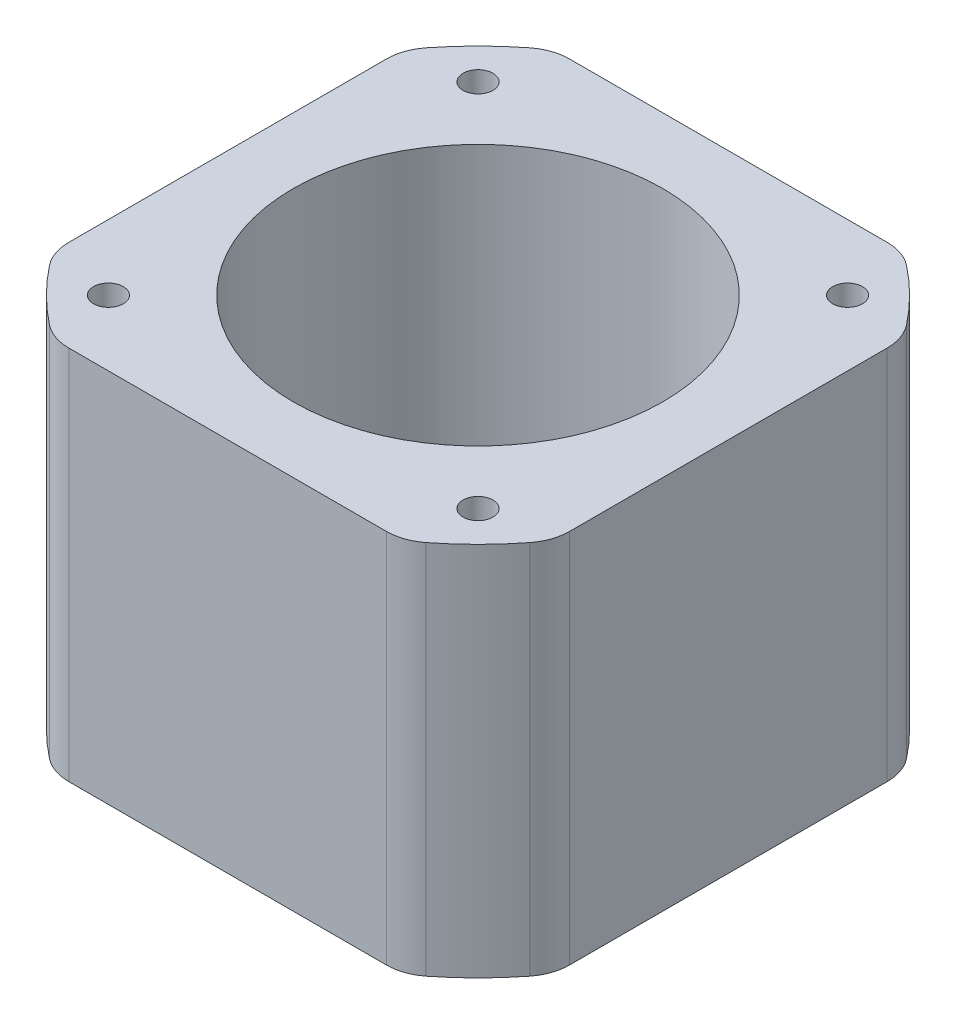
ISO-10303-21;
HEADER;
FILE_DESCRIPTION(('STEP AP214'),'2;1');
FILE_NAME('part.step','',(''),(''),'','','');
FILE_SCHEMA(('AUTOMOTIVE_DESIGN { 1 0 10303 214 1 1 1 1 }'));
ENDSEC;
DATA;
#1=APPLICATION_CONTEXT('core data for automotive mechanical design processes');
#2=APPLICATION_PROTOCOL_DEFINITION('international standard','automotive_design',2000,#1);
#3=PRODUCT_CONTEXT('',#1,'mechanical');
#4=PRODUCT('Part','Part','',(#3));
#5=PRODUCT_RELATED_PRODUCT_CATEGORY('part','',(#4));
#6=PRODUCT_DEFINITION_FORMATION('','',#4);
#7=PRODUCT_DEFINITION_CONTEXT('part definition',#1,'design');
#8=PRODUCT_DEFINITION('design','',#6,#7);
#9=PRODUCT_DEFINITION_SHAPE('','',#8);
#10=(LENGTH_UNIT() NAMED_UNIT(*) SI_UNIT(.MILLI.,.METRE.));
#11=(NAMED_UNIT(*) PLANE_ANGLE_UNIT() SI_UNIT($,.RADIAN.));
#12=(NAMED_UNIT(*) SI_UNIT($,.STERADIAN.) SOLID_ANGLE_UNIT());
#13=UNCERTAINTY_MEASURE_WITH_UNIT(LENGTH_MEASURE(1.E-05),#10,'distance_accuracy_value','');
#14=(GEOMETRIC_REPRESENTATION_CONTEXT(3) GLOBAL_UNCERTAINTY_ASSIGNED_CONTEXT((#13)) GLOBAL_UNIT_ASSIGNED_CONTEXT((#10,
#11,#12)) REPRESENTATION_CONTEXT('',''));
#15=CARTESIAN_POINT('',(0.,0.,0.));
#16=DIRECTION('',(0.,0.,1.));
#17=DIRECTION('',(1.,0.,0.));
#18=AXIS2_PLACEMENT_3D('',#15,#16,#17);
#19=CARTESIAN_POINT('',(15.5,31.5,15.5));
#20=DIRECTION('',(0.,-1.,0.));
#21=DIRECTION('',(0.,0.,-1.));
#22=AXIS2_PLACEMENT_3D('',#19,#20,#21);
#23=CYLINDRICAL_SURFACE('',#22,1.25000000000001);
#24=CARTESIAN_POINT('',(15.5,31.5,15.5));
#25=DIRECTION('',(0.,-1.,0.));
#26=DIRECTION('',(0.,0.,-1.));
#27=AXIS2_PLACEMENT_3D('',#24,#25,#26);
#28=CIRCLE('',#27,1.25000000000001);
#29=CARTESIAN_POINT('',(15.5,31.5,14.25));
#30=VERTEX_POINT('',#29);
#31=EDGE_CURVE('E206',#30,#30,#28,.T.);
#32=ORIENTED_EDGE('',*,*,#31,.F.);
#33=EDGE_LOOP('',(#32));
#34=FACE_BOUND('',#33,.T.);
#35=CARTESIAN_POINT('',(15.5,0.,15.5));
#36=DIRECTION('',(0.,-1.,0.));
#37=DIRECTION('',(0.,0.,-1.));
#38=AXIS2_PLACEMENT_3D('',#35,#36,#37);
#39=CIRCLE('',#38,1.25000000000001);
#40=CARTESIAN_POINT('',(15.5,0.,14.25));
#41=VERTEX_POINT('',#40);
#42=EDGE_CURVE('E28',#41,#41,#39,.T.);
#43=ORIENTED_EDGE('',*,*,#42,.T.);
#44=EDGE_LOOP('',(#43));
#45=FACE_BOUND('',#44,.T.);
#46=ADVANCED_FACE('F25',(#34,#45),#23,.F.);
#47=CARTESIAN_POINT('',(-15.5,31.5,-15.5));
#48=DIRECTION('',(0.,-1.,0.));
#49=DIRECTION('',(0.,0.,-1.));
#50=AXIS2_PLACEMENT_3D('',#47,#48,#49);
#51=CYLINDRICAL_SURFACE('',#50,1.25000000000001);
#52=CARTESIAN_POINT('',(-15.5,31.5,-15.5));
#53=DIRECTION('',(0.,-1.,0.));
#54=DIRECTION('',(0.,0.,-1.));
#55=AXIS2_PLACEMENT_3D('',#52,#53,#54);
#56=CIRCLE('',#55,1.25000000000001);
#57=CARTESIAN_POINT('',(-15.5,31.5,-16.75));
#58=VERTEX_POINT('',#57);
#59=EDGE_CURVE('E209',#58,#58,#56,.T.);
#60=ORIENTED_EDGE('',*,*,#59,.F.);
#61=EDGE_LOOP('',(#60));
#62=FACE_BOUND('',#61,.T.);
#63=CARTESIAN_POINT('',(-15.5,0.,-15.5));
#64=DIRECTION('',(0.,-1.,0.));
#65=DIRECTION('',(0.,0.,-1.));
#66=AXIS2_PLACEMENT_3D('',#63,#64,#65);
#67=CIRCLE('',#66,1.25000000000001);
#68=CARTESIAN_POINT('',(-15.5,0.,-16.75));
#69=VERTEX_POINT('',#68);
#70=EDGE_CURVE('E164',#69,#69,#67,.T.);
#71=ORIENTED_EDGE('',*,*,#70,.T.);
#72=EDGE_LOOP('',(#71));
#73=FACE_BOUND('',#72,.T.);
#74=ADVANCED_FACE('F528',(#62,#73),#51,.F.);
#75=CARTESIAN_POINT('',(0.,31.5,0.));
#76=DIRECTION('',(0.,-1.,0.));
#77=DIRECTION('',(0.,0.,-1.));
#78=AXIS2_PLACEMENT_3D('',#75,#76,#77);
#79=CYLINDRICAL_SURFACE('',#78,25.6);
#80=CARTESIAN_POINT('',(0.,31.5,0.));
#81=DIRECTION('',(0.,-1.,0.));
#82=DIRECTION('',(0.,0.,-1.));
#83=AXIS2_PLACEMENT_3D('',#80,#81,#82);
#84=CIRCLE('',#83,25.6);
#85=CARTESIAN_POINT('',(-15.7927871574424,31.5,-20.1481481481482));
#86=VERTEX_POINT('',#85);
#87=CARTESIAN_POINT('',(-20.1481481481482,31.5,-15.7927871574423));
#88=VERTEX_POINT('',#87);
#89=EDGE_CURVE('E212',#86,#88,#84,.F.);
#90=ORIENTED_EDGE('',*,*,#89,.F.);
#91=DIRECTION('',(0.,-1.,0.));
#92=VECTOR('',#91,1.);
#93=CARTESIAN_POINT('',(-15.7927871574424,31.5,-20.1481481481482));
#94=LINE('',#93,#92);
#95=CARTESIAN_POINT('',(-15.7927871574424,0.,-20.1481481481482));
#96=VERTEX_POINT('',#95);
#97=EDGE_CURVE('E276',#96,#86,#94,.F.);
#98=ORIENTED_EDGE('',*,*,#97,.F.);
#99=CARTESIAN_POINT('',(0.,0.,0.));
#100=DIRECTION('',(0.,-1.,0.));
#101=DIRECTION('',(0.,0.,-1.));
#102=AXIS2_PLACEMENT_3D('',#99,#100,#101);
#103=CIRCLE('',#102,25.6);
#104=CARTESIAN_POINT('',(-20.1481481481482,0.,-15.7927871574423));
#105=VERTEX_POINT('',#104);
#106=EDGE_CURVE('E193',#96,#105,#103,.F.);
#107=ORIENTED_EDGE('',*,*,#106,.T.);
#108=DIRECTION('',(0.,-1.,0.));
#109=VECTOR('',#108,1.);
#110=CARTESIAN_POINT('',(-20.1481481481482,31.5,-15.7927871574423));
#111=LINE('',#110,#109);
#112=EDGE_CURVE('E246',#88,#105,#111,.T.);
#113=ORIENTED_EDGE('',*,*,#112,.F.);
#114=EDGE_LOOP('',(#90,#98,#107,#113));
#115=FACE_BOUND('',#114,.T.);
#116=ADVANCED_FACE('F320',(#115),#79,.T.);
#117=CARTESIAN_POINT('',(-17.,31.5,-13.325164164092));
#118=DIRECTION('',(0.,-1.,0.));
#119=DIRECTION('',(0.,0.,-1.));
#120=AXIS2_PLACEMENT_3D('',#117,#118,#119);
#121=CYLINDRICAL_SURFACE('',#120,4.);
#122=CARTESIAN_POINT('',(-17.,0.,-13.325164164092));
#123=DIRECTION('',(0.,-1.,0.));
#124=DIRECTION('',(0.,0.,-1.));
#125=AXIS2_PLACEMENT_3D('',#122,#123,#124);
#126=CIRCLE('',#125,4.);
#127=CARTESIAN_POINT('',(-21.,0.,-13.325164164092));
#128=VERTEX_POINT('',#127);
#129=EDGE_CURVE('E196',#105,#128,#126,.F.);
#130=ORIENTED_EDGE('',*,*,#129,.T.);
#131=DIRECTION('',(0.,1.,0.));
#132=VECTOR('',#131,1.);
#133=CARTESIAN_POINT('',(-21.,31.5,-13.325164164092));
#134=LINE('',#133,#132);
#135=CARTESIAN_POINT('',(-21.,31.5,-13.325164164092));
#136=VERTEX_POINT('',#135);
#137=EDGE_CURVE('E248',#128,#136,#134,.T.);
#138=ORIENTED_EDGE('',*,*,#137,.T.);
#139=CARTESIAN_POINT('',(-17.,31.5,-13.325164164092));
#140=DIRECTION('',(0.,-1.,0.));
#141=DIRECTION('',(0.,0.,-1.));
#142=AXIS2_PLACEMENT_3D('',#139,#140,#141);
#143=CIRCLE('',#142,4.);
#144=EDGE_CURVE('E214',#88,#136,#143,.F.);
#145=ORIENTED_EDGE('',*,*,#144,.F.);
#146=ORIENTED_EDGE('',*,*,#112,.T.);
#147=EDGE_LOOP('',(#130,#138,#145,#146));
#148=FACE_BOUND('',#147,.T.);
#149=ADVANCED_FACE('F324',(#148),#121,.T.);
#150=CARTESIAN_POINT('',(-21.,31.5,14.641038214553));
#151=DIRECTION('',(1.,0.,0.));
#152=DIRECTION('',(0.,0.,-1.));
#153=AXIS2_PLACEMENT_3D('',#150,#151,#152);
#154=PLANE('',#153);
#155=ORIENTED_EDGE('',*,*,#137,.F.);
#156=DIRECTION('',(0.,0.,1.));
#157=VECTOR('',#156,1.);
#158=CARTESIAN_POINT('',(-21.,0.,0.));
#159=LINE('',#158,#157);
#160=CARTESIAN_POINT('',(-21.,0.,13.325164164092));
#161=VERTEX_POINT('',#160);
#162=EDGE_CURVE('E199',#128,#161,#159,.T.);
#163=ORIENTED_EDGE('',*,*,#162,.T.);
#164=DIRECTION('',(0.,-1.,0.));
#165=VECTOR('',#164,1.);
#166=CARTESIAN_POINT('',(-21.,31.5,13.325164164092));
#167=LINE('',#166,#165);
#168=CARTESIAN_POINT('',(-21.,31.5,13.325164164092));
#169=VERTEX_POINT('',#168);
#170=EDGE_CURVE('E136',#169,#161,#167,.T.);
#171=ORIENTED_EDGE('',*,*,#170,.F.);
#172=DIRECTION('',(0.,0.,1.));
#173=VECTOR('',#172,1.);
#174=CARTESIAN_POINT('',(-21.,31.5,0.));
#175=LINE('',#174,#173);
#176=EDGE_CURVE('E216',#136,#169,#175,.T.);
#177=ORIENTED_EDGE('',*,*,#176,.F.);
#178=EDGE_LOOP('',(#155,#163,#171,#177));
#179=FACE_BOUND('',#178,.T.);
#180=ADVANCED_FACE('F327',(#179),#154,.F.);
#181=CARTESIAN_POINT('',(-17.,31.5,13.325164164092));
#182=DIRECTION('',(0.,-1.,0.));
#183=DIRECTION('',(0.,0.,-1.));
#184=AXIS2_PLACEMENT_3D('',#181,#182,#183);
#185=CYLINDRICAL_SURFACE('',#184,4.);
#186=CARTESIAN_POINT('',(-17.,0.,13.325164164092));
#187=DIRECTION('',(0.,-1.,0.));
#188=DIRECTION('',(0.,0.,-1.));
#189=AXIS2_PLACEMENT_3D('',#186,#187,#188);
#190=CIRCLE('',#189,4.);
#191=CARTESIAN_POINT('',(-20.1481481481482,0.,15.7927871574423));
#192=VERTEX_POINT('',#191);
#193=EDGE_CURVE('E157',#161,#192,#190,.F.);
#194=ORIENTED_EDGE('',*,*,#193,.T.);
#195=DIRECTION('',(0.,-1.,0.));
#196=VECTOR('',#195,1.);
#197=CARTESIAN_POINT('',(-20.1481481481482,31.5,15.7927871574423));
#198=LINE('',#197,#196);
#199=CARTESIAN_POINT('',(-20.1481481481482,31.5,15.7927871574423));
#200=VERTEX_POINT('',#199);
#201=EDGE_CURVE('E143',#200,#192,#198,.T.);
#202=ORIENTED_EDGE('',*,*,#201,.F.);
#203=CARTESIAN_POINT('',(-17.,31.5,13.325164164092));
#204=DIRECTION('',(0.,-1.,0.));
#205=DIRECTION('',(0.,0.,-1.));
#206=AXIS2_PLACEMENT_3D('',#203,#204,#205);
#207=CIRCLE('',#206,4.);
#208=EDGE_CURVE('E217',#169,#200,#207,.F.);
#209=ORIENTED_EDGE('',*,*,#208,.F.);
#210=ORIENTED_EDGE('',*,*,#170,.T.);
#211=EDGE_LOOP('',(#194,#202,#209,#210));
#212=FACE_BOUND('',#211,.T.);
#213=ADVANCED_FACE('F163',(#212),#185,.T.);
#214=CARTESIAN_POINT('',(0.,31.5,0.));
#215=DIRECTION('',(0.,-1.,0.));
#216=DIRECTION('',(0.,0.,-1.));
#217=AXIS2_PLACEMENT_3D('',#214,#215,#216);
#218=CYLINDRICAL_SURFACE('',#217,25.6);
#219=CARTESIAN_POINT('',(0.,31.5,0.));
#220=DIRECTION('',(0.,-1.,0.));
#221=DIRECTION('',(0.,0.,-1.));
#222=AXIS2_PLACEMENT_3D('',#219,#220,#221);
#223=CIRCLE('',#222,25.6);
#224=CARTESIAN_POINT('',(-15.7927871574423,31.5,20.1481481481482));
#225=VERTEX_POINT('',#224);
#226=EDGE_CURVE('E148',#200,#225,#223,.F.);
#227=ORIENTED_EDGE('',*,*,#226,.F.);
#228=ORIENTED_EDGE('',*,*,#201,.T.);
#229=CARTESIAN_POINT('',(0.,0.,0.));
#230=DIRECTION('',(0.,-1.,0.));
#231=DIRECTION('',(0.,0.,-1.));
#232=AXIS2_PLACEMENT_3D('',#229,#230,#231);
#233=CIRCLE('',#232,25.6);
#234=CARTESIAN_POINT('',(-15.7927871574423,0.,20.1481481481482));
#235=VERTEX_POINT('',#234);
#236=EDGE_CURVE('E147',#192,#235,#233,.F.);
#237=ORIENTED_EDGE('',*,*,#236,.T.);
#238=DIRECTION('',(0.,-1.,0.));
#239=VECTOR('',#238,1.);
#240=CARTESIAN_POINT('',(-15.7927871574423,31.5,20.1481481481482));
#241=LINE('',#240,#239);
#242=EDGE_CURVE('E149',#225,#235,#241,.T.);
#243=ORIENTED_EDGE('',*,*,#242,.F.);
#244=EDGE_LOOP('',(#227,#228,#237,#243));
#245=FACE_BOUND('',#244,.T.);
#246=ADVANCED_FACE('F145',(#245),#218,.T.);
#247=CARTESIAN_POINT('',(-13.325164164092,31.5,17.));
#248=DIRECTION('',(0.,-1.,0.));
#249=DIRECTION('',(0.,0.,-1.));
#250=AXIS2_PLACEMENT_3D('',#247,#248,#249);
#251=CYLINDRICAL_SURFACE('',#250,4.);
#252=CARTESIAN_POINT('',(-13.325164164092,0.,17.));
#253=DIRECTION('',(0.,-1.,0.));
#254=DIRECTION('',(0.,0.,-1.));
#255=AXIS2_PLACEMENT_3D('',#252,#253,#254);
#256=CIRCLE('',#255,4.);
#257=CARTESIAN_POINT('',(-13.325164164092,0.,21.));
#258=VERTEX_POINT('',#257);
#259=EDGE_CURVE('E161',#235,#258,#256,.F.);
#260=ORIENTED_EDGE('',*,*,#259,.T.);
#261=DIRECTION('',(0.,1.,0.));
#262=VECTOR('',#261,1.);
#263=CARTESIAN_POINT('',(-13.325164164092,31.5,21.));
#264=LINE('',#263,#262);
#265=CARTESIAN_POINT('',(-13.325164164092,31.5,21.));
#266=VERTEX_POINT('',#265);
#267=EDGE_CURVE('E253',#258,#266,#264,.T.);
#268=ORIENTED_EDGE('',*,*,#267,.T.);
#269=CARTESIAN_POINT('',(-13.325164164092,31.5,17.));
#270=DIRECTION('',(0.,-1.,0.));
#271=DIRECTION('',(0.,0.,-1.));
#272=AXIS2_PLACEMENT_3D('',#269,#270,#271);
#273=CIRCLE('',#272,4.);
#274=EDGE_CURVE('E220',#225,#266,#273,.F.);
#275=ORIENTED_EDGE('',*,*,#274,.F.);
#276=ORIENTED_EDGE('',*,*,#242,.T.);
#277=EDGE_LOOP('',(#260,#268,#275,#276));
#278=FACE_BOUND('',#277,.T.);
#279=ADVANCED_FACE('F346',(#278),#251,.T.);
#280=CARTESIAN_POINT('',(-14.641038214553,31.5,21.));
#281=DIRECTION('',(0.,0.,-1.));
#282=DIRECTION('',(-1.,0.,0.));
#283=AXIS2_PLACEMENT_3D('',#280,#281,#282);
#284=PLANE('',#283);
#285=DIRECTION('',(0.,-1.,0.));
#286=VECTOR('',#285,1.);
#287=CARTESIAN_POINT('',(13.3251641640919,31.5,21.));
#288=LINE('',#287,#286);
#289=CARTESIAN_POINT('',(13.3251641640919,31.5,21.));
#290=VERTEX_POINT('',#289);
#291=CARTESIAN_POINT('',(13.3251641640919,0.,21.));
#292=VERTEX_POINT('',#291);
#293=EDGE_CURVE('E256',#290,#292,#288,.T.);
#294=ORIENTED_EDGE('',*,*,#293,.F.);
#295=DIRECTION('',(1.,0.,0.));
#296=VECTOR('',#295,1.);
#297=CARTESIAN_POINT('',(0.,31.5,21.));
#298=LINE('',#297,#296);
#299=EDGE_CURVE('E222',#266,#290,#298,.T.);
#300=ORIENTED_EDGE('',*,*,#299,.F.);
#301=ORIENTED_EDGE('',*,*,#267,.F.);
#302=DIRECTION('',(1.,0.,0.));
#303=VECTOR('',#302,1.);
#304=CARTESIAN_POINT('',(0.,0.,21.));
#305=LINE('',#304,#303);
#306=EDGE_CURVE('E169',#258,#292,#305,.T.);
#307=ORIENTED_EDGE('',*,*,#306,.T.);
#308=EDGE_LOOP('',(#294,#300,#301,#307));
#309=FACE_BOUND('',#308,.T.);
#310=ADVANCED_FACE('F344',(#309),#284,.F.);
#311=CARTESIAN_POINT('',(13.3251641640919,31.5,17.));
#312=DIRECTION('',(0.,-1.,0.));
#313=DIRECTION('',(0.,0.,-1.));
#314=AXIS2_PLACEMENT_3D('',#311,#312,#313);
#315=CYLINDRICAL_SURFACE('',#314,4.);
#316=CARTESIAN_POINT('',(13.3251641640919,0.,17.));
#317=DIRECTION('',(0.,-1.,0.));
#318=DIRECTION('',(0.,0.,-1.));
#319=AXIS2_PLACEMENT_3D('',#316,#317,#318);
#320=CIRCLE('',#319,4.);
#321=CARTESIAN_POINT('',(15.7927871574423,0.,20.1481481481482));
#322=VERTEX_POINT('',#321);
#323=EDGE_CURVE('E170',#292,#322,#320,.F.);
#324=ORIENTED_EDGE('',*,*,#323,.T.);
#325=DIRECTION('',(0.,-1.,0.));
#326=VECTOR('',#325,1.);
#327=CARTESIAN_POINT('',(15.7927871574423,31.5,20.1481481481482));
#328=LINE('',#327,#326);
#329=CARTESIAN_POINT('',(15.7927871574423,31.5,20.1481481481482));
#330=VERTEX_POINT('',#329);
#331=EDGE_CURVE('E258',#330,#322,#328,.T.);
#332=ORIENTED_EDGE('',*,*,#331,.F.);
#333=CARTESIAN_POINT('',(13.3251641640919,31.5,17.));
#334=DIRECTION('',(0.,-1.,0.));
#335=DIRECTION('',(0.,0.,-1.));
#336=AXIS2_PLACEMENT_3D('',#333,#334,#335);
#337=CIRCLE('',#336,4.);
#338=EDGE_CURVE('E223',#290,#330,#337,.F.);
#339=ORIENTED_EDGE('',*,*,#338,.F.);
#340=ORIENTED_EDGE('',*,*,#293,.T.);
#341=EDGE_LOOP('',(#324,#332,#339,#340));
#342=FACE_BOUND('',#341,.T.);
#343=ADVANCED_FACE('F339',(#342),#315,.T.);
#344=CARTESIAN_POINT('',(0.,31.5,0.));
#345=DIRECTION('',(0.,-1.,0.));
#346=DIRECTION('',(0.,0.,-1.));
#347=AXIS2_PLACEMENT_3D('',#344,#345,#346);
#348=CYLINDRICAL_SURFACE('',#347,25.6);
#349=CARTESIAN_POINT('',(0.,31.5,0.));
#350=DIRECTION('',(0.,-1.,0.));
#351=DIRECTION('',(0.,0.,-1.));
#352=AXIS2_PLACEMENT_3D('',#349,#350,#351);
#353=CIRCLE('',#352,25.6);
#354=CARTESIAN_POINT('',(20.1481481481481,31.5,15.7927871574423));
#355=VERTEX_POINT('',#354);
#356=EDGE_CURVE('E225',#330,#355,#353,.F.);
#357=ORIENTED_EDGE('',*,*,#356,.F.);
#358=ORIENTED_EDGE('',*,*,#331,.T.);
#359=CARTESIAN_POINT('',(0.,0.,0.));
#360=DIRECTION('',(0.,-1.,0.));
#361=DIRECTION('',(0.,0.,-1.));
#362=AXIS2_PLACEMENT_3D('',#359,#360,#361);
#363=CIRCLE('',#362,25.6);
#364=CARTESIAN_POINT('',(20.1481481481481,0.,15.7927871574423));
#365=VERTEX_POINT('',#364);
#366=EDGE_CURVE('E173',#322,#365,#363,.F.);
#367=ORIENTED_EDGE('',*,*,#366,.T.);
#368=DIRECTION('',(0.,-1.,0.));
#369=VECTOR('',#368,1.);
#370=CARTESIAN_POINT('',(20.1481481481481,31.5,15.7927871574423));
#371=LINE('',#370,#369);
#372=EDGE_CURVE('E260',#355,#365,#371,.T.);
#373=ORIENTED_EDGE('',*,*,#372,.F.);
#374=EDGE_LOOP('',(#357,#358,#367,#373));
#375=FACE_BOUND('',#374,.T.);
#376=ADVANCED_FACE('F335',(#375),#348,.T.);
#377=CARTESIAN_POINT('',(17.,31.5,13.3251641640919));
#378=DIRECTION('',(0.,-1.,0.));
#379=DIRECTION('',(0.,0.,-1.));
#380=AXIS2_PLACEMENT_3D('',#377,#378,#379);
#381=CYLINDRICAL_SURFACE('',#380,4.);
#382=CARTESIAN_POINT('',(17.,0.,13.3251641640919));
#383=DIRECTION('',(0.,-1.,0.));
#384=DIRECTION('',(0.,0.,-1.));
#385=AXIS2_PLACEMENT_3D('',#382,#383,#384);
#386=CIRCLE('',#385,4.);
#387=CARTESIAN_POINT('',(21.,0.,13.3251641640919));
#388=VERTEX_POINT('',#387);
#389=EDGE_CURVE('E176',#365,#388,#386,.F.);
#390=ORIENTED_EDGE('',*,*,#389,.T.);
#391=DIRECTION('',(0.,1.,0.));
#392=VECTOR('',#391,1.);
#393=CARTESIAN_POINT('',(21.,31.5,13.3251641640919));
#394=LINE('',#393,#392);
#395=CARTESIAN_POINT('',(21.,31.5,13.3251641640919));
#396=VERTEX_POINT('',#395);
#397=EDGE_CURVE('E262',#388,#396,#394,.T.);
#398=ORIENTED_EDGE('',*,*,#397,.T.);
#399=CARTESIAN_POINT('',(17.,31.5,13.3251641640919));
#400=DIRECTION('',(0.,-1.,0.));
#401=DIRECTION('',(0.,0.,-1.));
#402=AXIS2_PLACEMENT_3D('',#399,#400,#401);
#403=CIRCLE('',#402,4.);
#404=EDGE_CURVE('E227',#355,#396,#403,.F.);
#405=ORIENTED_EDGE('',*,*,#404,.F.);
#406=ORIENTED_EDGE('',*,*,#372,.T.);
#407=EDGE_LOOP('',(#390,#398,#405,#406));
#408=FACE_BOUND('',#407,.T.);
#409=ADVANCED_FACE('F331',(#408),#381,.T.);
#410=CARTESIAN_POINT('',(21.,31.5,14.641038214553));
#411=DIRECTION('',(-1.,0.,0.));
#412=DIRECTION('',(0.,0.,1.));
#413=AXIS2_PLACEMENT_3D('',#410,#411,#412);
#414=PLANE('',#413);
#415=DIRECTION('',(0.,-1.,0.));
#416=VECTOR('',#415,1.);
#417=CARTESIAN_POINT('',(21.,31.5,-13.3251641640919));
#418=LINE('',#417,#416);
#419=CARTESIAN_POINT('',(21.,31.5,-13.3251641640919));
#420=VERTEX_POINT('',#419);
#421=CARTESIAN_POINT('',(21.,0.,-13.3251641640919));
#422=VERTEX_POINT('',#421);
#423=EDGE_CURVE('E265',#420,#422,#418,.T.);
#424=ORIENTED_EDGE('',*,*,#423,.F.);
#425=DIRECTION('',(0.,0.,1.));
#426=VECTOR('',#425,1.);
#427=CARTESIAN_POINT('',(21.,31.5,0.));
#428=LINE('',#427,#426);
#429=EDGE_CURVE('E229',#396,#420,#428,.F.);
#430=ORIENTED_EDGE('',*,*,#429,.F.);
#431=ORIENTED_EDGE('',*,*,#397,.F.);
#432=DIRECTION('',(0.,0.,1.));
#433=VECTOR('',#432,1.);
#434=CARTESIAN_POINT('',(21.,0.,0.));
#435=LINE('',#434,#433);
#436=EDGE_CURVE('E179',#388,#422,#435,.F.);
#437=ORIENTED_EDGE('',*,*,#436,.T.);
#438=EDGE_LOOP('',(#424,#430,#431,#437));
#439=FACE_BOUND('',#438,.T.);
#440=ADVANCED_FACE('F296',(#439),#414,.F.);
#441=CARTESIAN_POINT('',(17.,31.5,-13.3251641640919));
#442=DIRECTION('',(0.,-1.,0.));
#443=DIRECTION('',(0.,0.,-1.));
#444=AXIS2_PLACEMENT_3D('',#441,#442,#443);
#445=CYLINDRICAL_SURFACE('',#444,4.);
#446=CARTESIAN_POINT('',(17.,0.,-13.3251641640919));
#447=DIRECTION('',(0.,-1.,0.));
#448=DIRECTION('',(0.,0.,-1.));
#449=AXIS2_PLACEMENT_3D('',#446,#447,#448);
#450=CIRCLE('',#449,4.);
#451=CARTESIAN_POINT('',(20.1481481481481,0.,-15.7927871574423));
#452=VERTEX_POINT('',#451);
#453=EDGE_CURVE('E180',#422,#452,#450,.F.);
#454=ORIENTED_EDGE('',*,*,#453,.T.);
#455=DIRECTION('',(0.,-1.,0.));
#456=VECTOR('',#455,1.);
#457=CARTESIAN_POINT('',(20.1481481481481,31.5,-15.7927871574423));
#458=LINE('',#457,#456);
#459=CARTESIAN_POINT('',(20.1481481481481,31.5,-15.7927871574423));
#460=VERTEX_POINT('',#459);
#461=EDGE_CURVE('E267',#460,#452,#458,.T.);
#462=ORIENTED_EDGE('',*,*,#461,.F.);
#463=CARTESIAN_POINT('',(17.,31.5,-13.3251641640919));
#464=DIRECTION('',(0.,-1.,0.));
#465=DIRECTION('',(0.,0.,-1.));
#466=AXIS2_PLACEMENT_3D('',#463,#464,#465);
#467=CIRCLE('',#466,4.);
#468=EDGE_CURVE('E230',#420,#460,#467,.F.);
#469=ORIENTED_EDGE('',*,*,#468,.F.);
#470=ORIENTED_EDGE('',*,*,#423,.T.);
#471=EDGE_LOOP('',(#454,#462,#469,#470));
#472=FACE_BOUND('',#471,.T.);
#473=ADVANCED_FACE('F300',(#472),#445,.T.);
#474=CARTESIAN_POINT('',(0.,31.5,0.));
#475=DIRECTION('',(0.,-1.,0.));
#476=DIRECTION('',(0.,0.,-1.));
#477=AXIS2_PLACEMENT_3D('',#474,#475,#476);
#478=CYLINDRICAL_SURFACE('',#477,25.6);
#479=CARTESIAN_POINT('',(0.,31.5,0.));
#480=DIRECTION('',(0.,-1.,0.));
#481=DIRECTION('',(0.,0.,-1.));
#482=AXIS2_PLACEMENT_3D('',#479,#480,#481);
#483=CIRCLE('',#482,25.6);
#484=CARTESIAN_POINT('',(15.7927871574423,31.5,-20.1481481481482));
#485=VERTEX_POINT('',#484);
#486=EDGE_CURVE('E232',#460,#485,#483,.F.);
#487=ORIENTED_EDGE('',*,*,#486,.F.);
#488=ORIENTED_EDGE('',*,*,#461,.T.);
#489=CARTESIAN_POINT('',(0.,0.,0.));
#490=DIRECTION('',(0.,-1.,0.));
#491=DIRECTION('',(0.,0.,-1.));
#492=AXIS2_PLACEMENT_3D('',#489,#490,#491);
#493=CIRCLE('',#492,25.6);
#494=CARTESIAN_POINT('',(15.7927871574423,0.,-20.1481481481482));
#495=VERTEX_POINT('',#494);
#496=EDGE_CURVE('E183',#452,#495,#493,.F.);
#497=ORIENTED_EDGE('',*,*,#496,.T.);
#498=DIRECTION('',(0.,-1.,0.));
#499=VECTOR('',#498,1.);
#500=CARTESIAN_POINT('',(15.7927871574423,31.5,-20.1481481481482));
#501=LINE('',#500,#499);
#502=EDGE_CURVE('E269',#485,#495,#501,.T.);
#503=ORIENTED_EDGE('',*,*,#502,.F.);
#504=EDGE_LOOP('',(#487,#488,#497,#503));
#505=FACE_BOUND('',#504,.T.);
#506=ADVANCED_FACE('F305',(#505),#478,.T.);
#507=CARTESIAN_POINT('',(13.3251641640919,31.5,-17.));
#508=DIRECTION('',(0.,-1.,0.));
#509=DIRECTION('',(0.,0.,-1.));
#510=AXIS2_PLACEMENT_3D('',#507,#508,#509);
#511=CYLINDRICAL_SURFACE('',#510,4.);
#512=CARTESIAN_POINT('',(13.3251641640919,0.,-17.));
#513=DIRECTION('',(0.,-1.,0.));
#514=DIRECTION('',(0.,0.,-1.));
#515=AXIS2_PLACEMENT_3D('',#512,#513,#514);
#516=CIRCLE('',#515,4.);
#517=CARTESIAN_POINT('',(13.3251641640919,0.,-21.));
#518=VERTEX_POINT('',#517);
#519=EDGE_CURVE('E186',#495,#518,#516,.F.);
#520=ORIENTED_EDGE('',*,*,#519,.T.);
#521=DIRECTION('',(0.,1.,0.));
#522=VECTOR('',#521,1.);
#523=CARTESIAN_POINT('',(13.3251641640919,31.5,-21.));
#524=LINE('',#523,#522);
#525=CARTESIAN_POINT('',(13.3251641640919,31.5,-21.));
#526=VERTEX_POINT('',#525);
#527=EDGE_CURVE('E271',#518,#526,#524,.T.);
#528=ORIENTED_EDGE('',*,*,#527,.T.);
#529=CARTESIAN_POINT('',(13.3251641640919,31.5,-17.));
#530=DIRECTION('',(0.,-1.,0.));
#531=DIRECTION('',(0.,0.,-1.));
#532=AXIS2_PLACEMENT_3D('',#529,#530,#531);
#533=CIRCLE('',#532,4.);
#534=EDGE_CURVE('E234',#485,#526,#533,.F.);
#535=ORIENTED_EDGE('',*,*,#534,.F.);
#536=ORIENTED_EDGE('',*,*,#502,.T.);
#537=EDGE_LOOP('',(#520,#528,#535,#536));
#538=FACE_BOUND('',#537,.T.);
#539=ADVANCED_FACE('F308',(#538),#511,.T.);
#540=CARTESIAN_POINT('',(-14.641038214553,31.5,-21.));
#541=DIRECTION('',(0.,0.,1.));
#542=DIRECTION('',(1.,0.,0.));
#543=AXIS2_PLACEMENT_3D('',#540,#541,#542);
#544=PLANE('',#543);
#545=DIRECTION('',(0.,-1.,0.));
#546=VECTOR('',#545,1.);
#547=CARTESIAN_POINT('',(-13.325164164092,31.5,-21.));
#548=LINE('',#547,#546);
#549=CARTESIAN_POINT('',(-13.325164164092,31.5,-21.));
#550=VERTEX_POINT('',#549);
#551=CARTESIAN_POINT('',(-13.325164164092,0.,-21.));
#552=VERTEX_POINT('',#551);
#553=EDGE_CURVE('E274',#550,#552,#548,.T.);
#554=ORIENTED_EDGE('',*,*,#553,.F.);
#555=DIRECTION('',(1.,0.,0.));
#556=VECTOR('',#555,1.);
#557=CARTESIAN_POINT('',(0.,31.5,-21.));
#558=LINE('',#557,#556);
#559=EDGE_CURVE('E43',#526,#550,#558,.F.);
#560=ORIENTED_EDGE('',*,*,#559,.F.);
#561=ORIENTED_EDGE('',*,*,#527,.F.);
#562=DIRECTION('',(1.,0.,0.));
#563=VECTOR('',#562,1.);
#564=CARTESIAN_POINT('',(0.,0.,-21.));
#565=LINE('',#564,#563);
#566=EDGE_CURVE('E189',#518,#552,#565,.F.);
#567=ORIENTED_EDGE('',*,*,#566,.T.);
#568=EDGE_LOOP('',(#554,#560,#561,#567));
#569=FACE_BOUND('',#568,.T.);
#570=ADVANCED_FACE('F312',(#569),#544,.F.);
#571=CARTESIAN_POINT('',(-13.325164164092,31.5,-17.));
#572=DIRECTION('',(0.,-1.,0.));
#573=DIRECTION('',(0.,0.,-1.));
#574=AXIS2_PLACEMENT_3D('',#571,#572,#573);
#575=CYLINDRICAL_SURFACE('',#574,4.);
#576=CARTESIAN_POINT('',(-13.325164164092,0.,-17.));
#577=DIRECTION('',(0.,-1.,0.));
#578=DIRECTION('',(0.,0.,-1.));
#579=AXIS2_PLACEMENT_3D('',#576,#577,#578);
#580=CIRCLE('',#579,4.);
#581=EDGE_CURVE('E190',#552,#96,#580,.F.);
#582=ORIENTED_EDGE('',*,*,#581,.T.);
#583=ORIENTED_EDGE('',*,*,#97,.T.);
#584=CARTESIAN_POINT('',(-13.325164164092,31.5,-17.));
#585=DIRECTION('',(0.,-1.,0.));
#586=DIRECTION('',(0.,0.,-1.));
#587=AXIS2_PLACEMENT_3D('',#584,#585,#586);
#588=CIRCLE('',#587,4.);
#589=EDGE_CURVE('E236',#550,#86,#588,.F.);
#590=ORIENTED_EDGE('',*,*,#589,.F.);
#591=ORIENTED_EDGE('',*,*,#553,.T.);
#592=EDGE_LOOP('',(#582,#583,#590,#591));
#593=FACE_BOUND('',#592,.T.);
#594=ADVANCED_FACE('F316',(#593),#575,.T.);
#595=CARTESIAN_POINT('',(15.5,31.5,-15.5));
#596=DIRECTION('',(0.,-1.,0.));
#597=DIRECTION('',(0.,0.,-1.));
#598=AXIS2_PLACEMENT_3D('',#595,#596,#597);
#599=CYLINDRICAL_SURFACE('',#598,1.25000000000001);
#600=CARTESIAN_POINT('',(15.5,31.5,-15.5));
#601=DIRECTION('',(0.,-1.,0.));
#602=DIRECTION('',(0.,0.,-1.));
#603=AXIS2_PLACEMENT_3D('',#600,#601,#602);
#604=CIRCLE('',#603,1.25000000000001);
#605=CARTESIAN_POINT('',(15.5,31.5,-16.75));
#606=VERTEX_POINT('',#605);
#607=EDGE_CURVE('E238',#606,#606,#604,.T.);
#608=ORIENTED_EDGE('',*,*,#607,.F.);
#609=EDGE_LOOP('',(#608));
#610=FACE_BOUND('',#609,.T.);
#611=CARTESIAN_POINT('',(15.5,0.,-15.5));
#612=DIRECTION('',(0.,-1.,0.));
#613=DIRECTION('',(0.,0.,-1.));
#614=AXIS2_PLACEMENT_3D('',#611,#612,#613);
#615=CIRCLE('',#614,1.25000000000001);
#616=CARTESIAN_POINT('',(15.5,0.,-16.75));
#617=VERTEX_POINT('',#616);
#618=EDGE_CURVE('E200',#617,#617,#615,.T.);
#619=ORIENTED_EDGE('',*,*,#618,.T.);
#620=EDGE_LOOP('',(#619));
#621=FACE_BOUND('',#620,.T.);
#622=ADVANCED_FACE('F375',(#610,#621),#599,.F.);
#623=CARTESIAN_POINT('',(-15.5,31.5,15.5));
#624=DIRECTION('',(0.,-1.,0.));
#625=DIRECTION('',(0.,0.,-1.));
#626=AXIS2_PLACEMENT_3D('',#623,#624,#625);
#627=CYLINDRICAL_SURFACE('',#626,1.25000000000001);
#628=CARTESIAN_POINT('',(-15.5,31.5,15.5));
#629=DIRECTION('',(0.,-1.,0.));
#630=DIRECTION('',(0.,0.,-1.));
#631=AXIS2_PLACEMENT_3D('',#628,#629,#630);
#632=CIRCLE('',#631,1.25000000000001);
#633=CARTESIAN_POINT('',(-15.5,31.5,14.25));
#634=VERTEX_POINT('',#633);
#635=EDGE_CURVE('E241',#634,#634,#632,.T.);
#636=ORIENTED_EDGE('',*,*,#635,.F.);
#637=EDGE_LOOP('',(#636));
#638=FACE_BOUND('',#637,.T.);
#639=CARTESIAN_POINT('',(-15.5,0.,15.5));
#640=DIRECTION('',(0.,-1.,0.));
#641=DIRECTION('',(0.,0.,-1.));
#642=AXIS2_PLACEMENT_3D('',#639,#640,#641);
#643=CIRCLE('',#642,1.25000000000001);
#644=CARTESIAN_POINT('',(-15.5,0.,14.25));
#645=VERTEX_POINT('',#644);
#646=EDGE_CURVE('E203',#645,#645,#643,.T.);
#647=ORIENTED_EDGE('',*,*,#646,.T.);
#648=EDGE_LOOP('',(#647));
#649=FACE_BOUND('',#648,.T.);
#650=ADVANCED_FACE('F371',(#638,#649),#627,.F.);
#651=CARTESIAN_POINT('',(0.,0.,0.));
#652=DIRECTION('',(0.,1.,0.));
#653=DIRECTION('',(0.,0.,1.));
#654=AXIS2_PLACEMENT_3D('',#651,#652,#653);
#655=PLANE('',#654);
#656=ORIENTED_EDGE('',*,*,#646,.F.);
#657=EDGE_LOOP('',(#656));
#658=FACE_BOUND('',#657,.T.);
#659=ORIENTED_EDGE('',*,*,#618,.F.);
#660=EDGE_LOOP('',(#659));
#661=FACE_BOUND('',#660,.T.);
#662=CARTESIAN_POINT('',(0.,0.,0.));
#663=DIRECTION('',(0.,-1.,0.));
#664=DIRECTION('',(0.,0.,-1.));
#665=AXIS2_PLACEMENT_3D('',#662,#663,#664);
#666=CIRCLE('',#665,15.5);
#667=CARTESIAN_POINT('',(0.,0.,-15.5));
#668=VERTEX_POINT('',#667);
#669=EDGE_CURVE('E34',#668,#668,#666,.F.);
#670=ORIENTED_EDGE('',*,*,#669,.T.);
#671=EDGE_LOOP('',(#670));
#672=FACE_BOUND('',#671,.T.);
#673=ORIENTED_EDGE('',*,*,#129,.F.);
#674=ORIENTED_EDGE('',*,*,#106,.F.);
#675=ORIENTED_EDGE('',*,*,#581,.F.);
#676=ORIENTED_EDGE('',*,*,#566,.F.);
#677=ORIENTED_EDGE('',*,*,#519,.F.);
#678=ORIENTED_EDGE('',*,*,#496,.F.);
#679=ORIENTED_EDGE('',*,*,#453,.F.);
#680=ORIENTED_EDGE('',*,*,#436,.F.);
#681=ORIENTED_EDGE('',*,*,#389,.F.);
#682=ORIENTED_EDGE('',*,*,#366,.F.);
#683=ORIENTED_EDGE('',*,*,#323,.F.);
#684=ORIENTED_EDGE('',*,*,#306,.F.);
#685=ORIENTED_EDGE('',*,*,#259,.F.);
#686=ORIENTED_EDGE('',*,*,#236,.F.);
#687=ORIENTED_EDGE('',*,*,#193,.F.);
#688=ORIENTED_EDGE('',*,*,#162,.F.);
#689=EDGE_LOOP('',(#673,#674,#675,#676,#677,#678,#679,#680,#681,#682,#683,#684,#685,#686,#687,#688));
#690=FACE_BOUND('',#689,.T.);
#691=ORIENTED_EDGE('',*,*,#70,.F.);
#692=EDGE_LOOP('',(#691));
#693=FACE_BOUND('',#692,.T.);
#694=ORIENTED_EDGE('',*,*,#42,.F.);
#695=EDGE_LOOP('',(#694));
#696=FACE_BOUND('',#695,.T.);
#697=ADVANCED_FACE('F154',(#658,#661,#672,#690,#693,#696),#655,.F.);
#698=CARTESIAN_POINT('',(0.,31.5,0.));
#699=DIRECTION('',(0.,1.,0.));
#700=DIRECTION('',(0.,0.,1.));
#701=AXIS2_PLACEMENT_3D('',#698,#699,#700);
#702=PLANE('',#701);
#703=ORIENTED_EDGE('',*,*,#635,.T.);
#704=EDGE_LOOP('',(#703));
#705=FACE_BOUND('',#704,.T.);
#706=ORIENTED_EDGE('',*,*,#607,.T.);
#707=EDGE_LOOP('',(#706));
#708=FACE_BOUND('',#707,.T.);
#709=CARTESIAN_POINT('',(0.,31.5,0.));
#710=DIRECTION('',(0.,-1.,0.));
#711=DIRECTION('',(0.,0.,-1.));
#712=AXIS2_PLACEMENT_3D('',#709,#710,#711);
#713=CIRCLE('',#712,15.5);
#714=CARTESIAN_POINT('',(0.,31.5,-15.5));
#715=VERTEX_POINT('',#714);
#716=EDGE_CURVE('E13',#715,#715,#713,.T.);
#717=ORIENTED_EDGE('',*,*,#716,.T.);
#718=EDGE_LOOP('',(#717));
#719=FACE_BOUND('',#718,.T.);
#720=ORIENTED_EDGE('',*,*,#559,.T.);
#721=ORIENTED_EDGE('',*,*,#589,.T.);
#722=ORIENTED_EDGE('',*,*,#89,.T.);
#723=ORIENTED_EDGE('',*,*,#144,.T.);
#724=ORIENTED_EDGE('',*,*,#176,.T.);
#725=ORIENTED_EDGE('',*,*,#208,.T.);
#726=ORIENTED_EDGE('',*,*,#226,.T.);
#727=ORIENTED_EDGE('',*,*,#274,.T.);
#728=ORIENTED_EDGE('',*,*,#299,.T.);
#729=ORIENTED_EDGE('',*,*,#338,.T.);
#730=ORIENTED_EDGE('',*,*,#356,.T.);
#731=ORIENTED_EDGE('',*,*,#404,.T.);
#732=ORIENTED_EDGE('',*,*,#429,.T.);
#733=ORIENTED_EDGE('',*,*,#468,.T.);
#734=ORIENTED_EDGE('',*,*,#486,.T.);
#735=ORIENTED_EDGE('',*,*,#534,.T.);
#736=EDGE_LOOP('',(#720,#721,#722,#723,#724,#725,#726,#727,#728,#729,#730,#731,#732,#733,#734,#735));
#737=FACE_BOUND('',#736,.T.);
#738=ORIENTED_EDGE('',*,*,#59,.T.);
#739=EDGE_LOOP('',(#738));
#740=FACE_BOUND('',#739,.T.);
#741=ORIENTED_EDGE('',*,*,#31,.T.);
#742=EDGE_LOOP('',(#741));
#743=FACE_BOUND('',#742,.T.);
#744=ADVANCED_FACE('F290',(#705,#708,#719,#737,#740,#743),#702,.T.);
#745=CARTESIAN_POINT('',(0.,31.5,0.));
#746=DIRECTION('',(0.,-1.,0.));
#747=DIRECTION('',(0.,0.,-1.));
#748=AXIS2_PLACEMENT_3D('',#745,#746,#747);
#749=CYLINDRICAL_SURFACE('',#748,15.5);
#750=ORIENTED_EDGE('',*,*,#669,.F.);
#751=EDGE_LOOP('',(#750));
#752=FACE_BOUND('',#751,.T.);
#753=ORIENTED_EDGE('',*,*,#716,.F.);
#754=EDGE_LOOP('',(#753));
#755=FACE_BOUND('',#754,.T.);
#756=ADVANCED_FACE('F357',(#752,#755),#749,.F.);
#757=CLOSED_SHELL('',(#46,#74,#116,#149,#180,#213,#246,#279,#310,#343,#376,#409,#440,#473,#506,
#539,#570,#594,#622,#650,#697,#744,#756));
#758=MANIFOLD_SOLID_BREP('B1',#757);
#759=ADVANCED_BREP_SHAPE_REPRESENTATION('',(#18,#758),#14);
#760=SHAPE_DEFINITION_REPRESENTATION(#9,#759);
ENDSEC;
END-ISO-10303-21;
